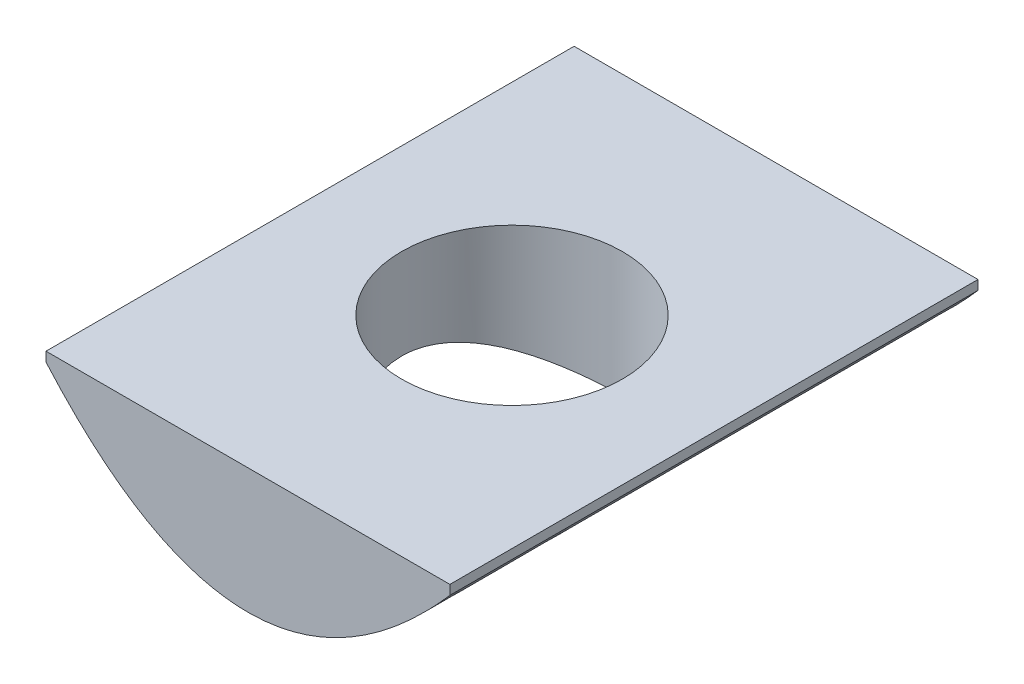
ISO-10303-21;
HEADER;
FILE_DESCRIPTION(('STEP AP214'),'2;1');
FILE_NAME('part.step','',(''),(''),'','','');
FILE_SCHEMA(('AUTOMOTIVE_DESIGN { 1 0 10303 214 1 1 1 1 }'));
ENDSEC;
DATA;
#1=APPLICATION_CONTEXT('core data for automotive mechanical design processes');
#2=APPLICATION_PROTOCOL_DEFINITION('international standard','automotive_design',2000,#1);
#3=PRODUCT_CONTEXT('',#1,'mechanical');
#4=PRODUCT('Part','Part','',(#3));
#5=PRODUCT_RELATED_PRODUCT_CATEGORY('part','',(#4));
#6=PRODUCT_DEFINITION_FORMATION('','',#4);
#7=PRODUCT_DEFINITION_CONTEXT('part definition',#1,'design');
#8=PRODUCT_DEFINITION('design','',#6,#7);
#9=PRODUCT_DEFINITION_SHAPE('','',#8);
#10=(LENGTH_UNIT() NAMED_UNIT(*) SI_UNIT(.MILLI.,.METRE.));
#11=(NAMED_UNIT(*) PLANE_ANGLE_UNIT() SI_UNIT($,.RADIAN.));
#12=(NAMED_UNIT(*) SI_UNIT($,.STERADIAN.) SOLID_ANGLE_UNIT());
#13=UNCERTAINTY_MEASURE_WITH_UNIT(LENGTH_MEASURE(1.E-05),#10,'distance_accuracy_value','');
#14=(GEOMETRIC_REPRESENTATION_CONTEXT(3) GLOBAL_UNCERTAINTY_ASSIGNED_CONTEXT((#13)) GLOBAL_UNIT_ASSIGNED_CONTEXT((#10,
#11,#12)) REPRESENTATION_CONTEXT('',''));
#15=CARTESIAN_POINT('',(0.,0.,0.));
#16=DIRECTION('',(0.,0.,1.));
#17=DIRECTION('',(1.,0.,0.));
#18=AXIS2_PLACEMENT_3D('',#15,#16,#17);
#19=CARTESIAN_POINT('',(-5.4102,0.,14.1478));
#20=DIRECTION('',(1.,0.,0.));
#21=DIRECTION('',(0.,1.,0.));
#22=AXIS2_PLACEMENT_3D('',#19,#20,#21);
#23=PLANE('',#22);
#24=DIRECTION('',(0.,-1.,0.));
#25=VECTOR('',#24,1.);
#26=CARTESIAN_POINT('',(-5.4102,0.,0.));
#27=LINE('',#26,#25);
#28=CARTESIAN_POINT('',(-5.4102,0.,0.));
#29=VERTEX_POINT('',#28);
#30=CARTESIAN_POINT('',(-5.4102,-0.254,0.));
#31=VERTEX_POINT('',#30);
#32=EDGE_CURVE('E104',#29,#31,#27,.T.);
#33=ORIENTED_EDGE('',*,*,#32,.T.);
#34=DIRECTION('',(0.,0.,-1.));
#35=VECTOR('',#34,1.);
#36=CARTESIAN_POINT('',(-5.4102,-0.254,14.1478));
#37=LINE('',#36,#35);
#38=CARTESIAN_POINT('',(-5.4102,-0.254,14.1478));
#39=VERTEX_POINT('',#38);
#40=EDGE_CURVE('E11',#39,#31,#37,.T.);
#41=ORIENTED_EDGE('',*,*,#40,.F.);
#42=DIRECTION('',(0.,-1.,0.));
#43=VECTOR('',#42,1.);
#44=CARTESIAN_POINT('',(-5.4102,0.,14.1478));
#45=LINE('',#44,#43);
#46=CARTESIAN_POINT('',(-5.4102,0.,14.1478));
#47=VERTEX_POINT('',#46);
#48=EDGE_CURVE('E87',#47,#39,#45,.T.);
#49=ORIENTED_EDGE('',*,*,#48,.F.);
#50=DIRECTION('',(0.,0.,-1.));
#51=VECTOR('',#50,1.);
#52=CARTESIAN_POINT('',(-5.4102,0.,14.1478));
#53=LINE('',#52,#51);
#54=EDGE_CURVE('E54',#47,#29,#53,.T.);
#55=ORIENTED_EDGE('',*,*,#54,.T.);
#56=EDGE_LOOP('',(#33,#41,#49,#55));
#57=FACE_BOUND('',#56,.T.);
#58=ADVANCED_FACE('F38',(#57),#23,.F.);
#59=CARTESIAN_POINT('',(-5.4102,-0.254,14.1478));
#60=CARTESIAN_POINT('',(6.34474339659379E-06,-6.4516005032583,14.1478));
#61=CARTESIAN_POINT('',(5.4102,-0.254,14.1478));
#62=B_SPLINE_CURVE_WITH_KNOTS('',2,(#59,#60,#61),.UNSPECIFIED.,.F.,.F.,(3,3),(0.,1.),.UNSPECIFIED.);
#63=DIRECTION('',(0.,0.,-1.));
#64=VECTOR('',#63,1.);
#65=SURFACE_OF_LINEAR_EXTRUSION('',#62,#64);
#66=CARTESIAN_POINT('',(-2.95909999999992,-2.4257850007738,7.0739));
#67=CARTESIAN_POINT('',(-2.95910155575033,-2.42578324394392,7.14975788518106));
#68=CARTESIAN_POINT('',(-2.95618027010238,-2.42761687921527,7.22559992110778));
#69=CARTESIAN_POINT('',(-2.94454274567432,-2.43488718088915,7.37668784572179));
#70=CARTESIAN_POINT('',(-2.93582508357045,-2.44032473224685,7.45193358339221));
#71=CARTESIAN_POINT('',(-2.91270623783965,-2.45463934176923,7.60127937510899));
#72=CARTESIAN_POINT('',(-2.89830018251729,-2.46351934802723,7.67537839039418));
#73=CARTESIAN_POINT('',(-2.86400243650349,-2.484441846718,7.82185103516712));
#74=CARTESIAN_POINT('',(-2.8441084085587,-2.49648568648014,7.89422391521724));
#75=CARTESIAN_POINT('',(-2.77679134628277,-2.5367069361701,8.10721808862584));
#76=CARTESIAN_POINT('',(-2.72158064409368,-2.56907328661306,8.24467608098714));
#77=CARTESIAN_POINT('',(-2.59248468194782,-2.64169822712562,8.50808091981414));
#78=CARTESIAN_POINT('',(-2.51859575734378,-2.6819583655998,8.6340255007505));
#79=CARTESIAN_POINT('',(-2.34670829684544,-2.77062538723167,8.88335447828144));
#80=CARTESIAN_POINT('',(-2.24715357289462,-2.81943804082794,9.00552315316439));
#81=CARTESIAN_POINT('',(-2.03011364377684,-2.91772674406611,9.23251846413394));
#82=CARTESIAN_POINT('',(-1.9126133051265,-2.96720332116733,9.33733030629446));
#83=CARTESIAN_POINT('',(-1.64806120304159,-3.06728132675758,9.53772539320782));
#84=CARTESIAN_POINT('',(-1.49920191803278,-3.1174552652414,9.63118367961926));
#85=CARTESIAN_POINT('',(-1.263501875402,-3.18444410046213,9.7511437528189));
#86=CARTESIAN_POINT('',(-1.18284028104731,-3.20540014217975,9.78776726830039));
#87=CARTESIAN_POINT('',(-1.01785687480364,-3.24383466662989,9.85384955496454));
#88=CARTESIAN_POINT('',(-0.93353749793776,-3.26131542089816,9.88331300896395));
#89=CARTESIAN_POINT('',(-0.768598028789895,-3.29092168484371,9.93263257669461));
#90=CARTESIAN_POINT('',(-0.688204294542441,-3.30335907808869,9.95305981301206));
#91=CARTESIAN_POINT('',(-0.525524721249312,-3.32426112600528,9.98714496583112));
#92=CARTESIAN_POINT('',(-0.443239986238496,-3.33272803992999,10.0008067322195));
#93=CARTESIAN_POINT('',(-0.277542789297945,-3.34537115499417,10.0211369018438));
#94=CARTESIAN_POINT('',(-0.19413118659894,-3.34955045688393,10.0278103590148));
#95=CARTESIAN_POINT('',(-0.0269395581516571,-3.35346287969927,10.0340592183736));
#96=CARTESIAN_POINT('',(0.0568404355185832,-3.35319638037228,10.0336352268049));
#97=CARTESIAN_POINT('',(0.212410221501387,-3.34857369959254,10.0262479083843));
#98=CARTESIAN_POINT('',(0.284262384289898,-3.34478575941295,10.0201931495805));
#99=CARTESIAN_POINT('',(0.427120912444159,-3.33402697389136,10.0028962088644));
#100=CARTESIAN_POINT('',(0.498127008615237,-3.32705514188243,9.99165241889455));
#101=CARTESIAN_POINT('',(0.638775348125541,-3.3101260834878,9.96412005622922));
#102=CARTESIAN_POINT('',(0.708417867890002,-3.30016946899669,9.94783251750367));
#103=CARTESIAN_POINT('',(0.845943808091944,-3.27754072638448,9.91040100589514));
#104=CARTESIAN_POINT('',(0.913826554437023,-3.26486757441456,9.8892552017408));
#105=CARTESIAN_POINT('',(1.11592019772906,-3.22289717950781,9.81826173923299));
#106=CARTESIAN_POINT('',(1.24689325628923,-3.189862761647,9.76119187464609));
#107=CARTESIAN_POINT('',(1.49785205219057,-3.1169524190658,9.62983847514835));
#108=CARTESIAN_POINT('',(1.61782878535346,-3.07707096317613,9.55554100630146));
#109=CARTESIAN_POINT('',(1.79629068429304,-3.01164453412536,9.4267708480175));
#110=CARTESIAN_POINT('',(1.85904588541713,-2.98730303504798,9.37749803509169));
#111=CARTESIAN_POINT('',(1.98019037129675,-2.93806257523052,9.2742287198395));
#112=CARTESIAN_POINT('',(2.03858373950539,-2.91316416497673,9.22023674094433));
#113=CARTESIAN_POINT('',(2.20710360097129,-2.83842027001326,9.05134552200964));
#114=CARTESIAN_POINT('',(2.31048038849287,-2.78856029968815,8.92959576234755));
#115=CARTESIAN_POINT('',(2.50563241489125,-2.6892395104989,8.6577323525599));
#116=CARTESIAN_POINT('',(2.59547534942246,-2.64023429799889,8.50604168033736));
#117=CARTESIAN_POINT('',(2.70957744268317,-2.57568666091692,8.2665039295091));
#118=CARTESIAN_POINT('',(2.74416950184487,-2.55566302671934,8.18465139805429));
#119=CARTESIAN_POINT('',(2.80606200602994,-2.51929627239442,8.01741768184001));
#120=CARTESIAN_POINT('',(2.83336354268317,-2.50295260131368,7.93203702756925));
#121=CARTESIAN_POINT('',(2.87809500527859,-2.47589479572932,7.76637530450449));
#122=CARTESIAN_POINT('',(2.89619686228035,-2.46480387861001,7.68633656919057));
#123=CARTESIAN_POINT('',(2.92573083696506,-2.44660060166844,7.52459517516842));
#124=CARTESIAN_POINT('',(2.93716399620301,-2.43948762055674,7.44289277836432));
#125=CARTESIAN_POINT('',(2.95316198334127,-2.42951132479795,7.27862413669357));
#126=CARTESIAN_POINT('',(2.95773222622228,-2.42664465974531,7.19605862469708));
#127=CARTESIAN_POINT('',(2.95993968726882,-2.42526177241451,7.03080062138602));
#128=CARTESIAN_POINT('',(2.95757736862607,-2.42674525948556,6.94810813892383));
#129=CARTESIAN_POINT('',(2.94672967510916,-2.43352479463917,6.7942686730351));
#130=CARTESIAN_POINT('',(2.93909268985607,-2.43829236878625,6.72303697222021));
#131=CARTESIAN_POINT('',(2.91873331300211,-2.45091765547078,6.58157516911201));
#132=CARTESIAN_POINT('',(2.90600937451497,-2.45877630795925,6.51134537822253));
#133=CARTESIAN_POINT('',(2.86042026174929,-2.48668559678633,6.30289294745469));
#134=CARTESIAN_POINT('',(2.82012931089566,-2.51107519898566,6.16679119140327));
#135=CARTESIAN_POINT('',(2.72016493314845,-2.5697179905148,5.90008413237997));
#136=CARTESIAN_POINT('',(2.660010021349,-2.60421352065172,5.7697172292704));
#137=CARTESIAN_POINT('',(2.52248224415229,-2.679669012807,5.52031000949572));
#138=CARTESIAN_POINT('',(2.4450954637423,-2.720634191354,5.40127895824892));
#139=CARTESIAN_POINT('',(2.31135196122582,-2.78746534024632,5.22445717842757));
#140=CARTESIAN_POINT('',(2.26017516118626,-2.81228750113928,5.16226446235286));
#141=CARTESIAN_POINT('',(2.15307379331542,-2.86232702174967,5.04239910603751));
#142=CARTESIAN_POINT('',(2.09715375206376,-2.88754398636332,4.98472225510238));
#143=CARTESIAN_POINT('',(1.9224405077531,-2.96297300616273,4.81860574113389));
#144=CARTESIAN_POINT('',(1.79675673855989,-3.01293069585533,4.71716260454288));
#145=CARTESIAN_POINT('',(1.51814679159323,-3.11100440766856,4.52791722675739));
#146=CARTESIAN_POINT('',(1.36384269816276,-3.15864933252004,4.44186773938741));
#147=CARTESIAN_POINT('',(1.12084433201734,-3.22049754964035,4.33385280218582));
#148=CARTESIAN_POINT('',(1.03792092629678,-3.2395104663822,4.30135764450377));
#149=CARTESIAN_POINT('',(0.868737707085259,-3.27365682266016,4.24378726169269));
#150=CARTESIAN_POINT('',(0.782478450151194,-3.28879090615856,4.21871080480726));
#151=CARTESIAN_POINT('',(0.616368240631742,-3.31323439729999,4.17857589717613));
#152=CARTESIAN_POINT('',(0.536764984173961,-3.32298141709498,4.1627548032206));
#153=CARTESIAN_POINT('',(0.376150927809358,-3.33850345409563,4.13768033911359));
#154=CARTESIAN_POINT('',(0.295140336532061,-3.34427905497641,4.12842600384634));
#155=CARTESIAN_POINT('',(0.132493465692102,-3.35164160943207,4.11664407065157));
#156=CARTESIAN_POINT('',(0.0508576210206347,-3.35323124864738,4.11411215972451));
#157=CARTESIAN_POINT('',(-0.112311633106154,-3.35216930199908,4.11580691510348));
#158=CARTESIAN_POINT('',(-0.193845050474874,-3.34951806689002,4.12003302246681));
#159=CARTESIAN_POINT('',(-0.345922324181204,-3.3406651277341,4.13422428518582));
#160=CARTESIAN_POINT('',(-0.416568747771942,-3.33494738465681,4.14340808015141));
#161=CARTESIAN_POINT('',(-0.556725133699432,-3.3205077824817,4.16677337590785));
#162=CARTESIAN_POINT('',(-0.626234747460923,-3.31178501940904,4.18095638059862));
#163=CARTESIAN_POINT('',(-0.832356694999482,-3.28144345961716,4.23076903590894));
#164=CARTESIAN_POINT('',(-0.966674233055766,-3.25564431145965,4.27367309488247));
#165=CARTESIAN_POINT('',(-1.23123928289376,-3.19424029858113,4.37919273053516));
#166=CARTESIAN_POINT('',(-1.36111617301195,-3.1582882095314,4.44252028976383));
#167=CARTESIAN_POINT('',(-1.60900937382756,-3.08034305091808,4.58634959919613));
#168=CARTESIAN_POINT('',(-1.72701999322131,-3.03834710585354,4.66685953315827));
#169=CARTESIAN_POINT('',(-1.96580022055222,-2.94540460440143,4.85615964174748));
#170=CARTESIAN_POINT('',(-2.08450075850983,-2.89404194218914,4.96735582637628));
#171=CARTESIAN_POINT('',(-2.30259005029578,-2.79275314775803,5.20822496546023));
#172=CARTESIAN_POINT('',(-2.40195819248352,-2.74282859658647,5.33791738760311));
#173=CARTESIAN_POINT('',(-2.53764493615823,-2.67127979777539,5.54933244952875));
#174=CARTESIAN_POINT('',(-2.58179934635442,-2.64728859199363,5.62532732319166));
#175=CARTESIAN_POINT('',(-2.66343401236004,-2.60195648027544,5.78155708881021));
#176=CARTESIAN_POINT('',(-2.70091755486041,-2.58061427077371,5.86178986736891));
#177=CARTESIAN_POINT('',(-2.76870394754778,-2.54136161109454,6.02584821499166));
#178=CARTESIAN_POINT('',(-2.79902125573365,-2.52344426542333,6.10966614017628));
#179=CARTESIAN_POINT('',(-2.85211433984992,-2.49167983805471,6.28036319121354));
#180=CARTESIAN_POINT('',(-2.87489417604963,-2.47783056542925,6.36724064096901));
#181=CARTESIAN_POINT('',(-2.91531102295733,-2.45306802674015,6.55630871241523));
#182=CARTESIAN_POINT('',(-2.93169448866571,-2.44288875961207,6.65886844324594));
#183=CARTESIAN_POINT('',(-2.95358744166761,-2.42924874145488,6.86559549840668));
#184=CARTESIAN_POINT('',(-2.95909786427373,-2.42578741254085,6.96976268368453));
#185=CARTESIAN_POINT('',(-2.95909999999992,-2.4257850007738,7.0739));
#186=B_SPLINE_CURVE_WITH_KNOTS('',3,(#66,#67,#68,#69,#70,#71,#72,#73,#74,#75,#76,#77,#78,#79,
#80,#81,#82,#83,#84,#85,#86,#87,#88,#89,#90,#91,#92,#93,#94,#95,#96,#97,#98,#99,#100,#101,#102,
#103,#104,#105,#106,#107,#108,#109,#110,#111,#112,#113,#114,#115,#116,#117,#118,#119,#120,#121,
#122,#123,#124,#125,#126,#127,#128,#129,#130,#131,#132,#133,#134,#135,#136,#137,#138,#139,#140,
#141,#142,#143,#144,#145,#146,#147,#148,#149,#150,#151,#152,#153,#154,#155,#156,#157,#158,#159,
#160,#161,#162,#163,#164,#165,#166,#167,#168,#169,#170,#171,#172,#173,#174,#175,#176,#177,#178,
#179,#180,#181,#182,#183,#184,#185),.UNSPECIFIED.,.T.,.F.,(4,2,2,2,2,2,2,2,2,2,2,2,2,2,2,2,2,2,
2,2,2,2,2,2,2,2,2,2,2,2,2,2,2,2,2,2,2,2,2,2,2,2,2,2,2,2,2,2,2,2,2,2,2,2,2,2,2,2,2,4),(0.,
0.227468236194017,0.454992348774853,0.682711743335688,0.910528270634619,1.36326401987308,
1.81608866441714,2.30903774886775,2.80240485485,3.34758190380341,3.62033621525785,
3.89291165718489,4.1441714449478,4.39528808870271,4.64622299958151,4.89713647643853,
5.11349682458719,5.32992426691639,5.54630737089821,5.76277217239074,6.20083034827399,
6.63924407552829,6.88926998731501,7.13905881785895,7.63897956881311,8.18472928264412,
8.45764343287422,8.73051669598066,8.97857526655854,9.22659508356172,9.47441910486701,
9.7222265684513,9.93736072406515,10.1525603494185,10.5826144136033,11.0239688018897,
11.4656808918659,11.7182936437919,11.9706679771853,12.4757385789765,13.021421598106,
13.2942646212031,13.5670623176309,13.8119397690589,14.0567812234173,14.3014655534272,
14.5461296471128,14.7602846773723,14.9745041864215,15.4026087907391,15.8476318852914,
16.2928674139181,16.8024913345695,17.3126556591789,17.5856569960645,17.858523452423,
18.130834605439,18.4029988307461,18.7152929256445,19.0275601554482),.UNSPECIFIED.);
#187=CARTESIAN_POINT('',(-2.95909999999992,-2.4257850007738,7.0739));
#188=VERTEX_POINT('',#187);
#189=EDGE_CURVE('E106',#188,#188,#186,.T.);
#190=ORIENTED_EDGE('',*,*,#189,.T.);
#191=EDGE_LOOP('',(#190));
#192=FACE_BOUND('',#191,.T.);
#193=CARTESIAN_POINT('',(-5.4102,-0.254,0.));
#194=CARTESIAN_POINT('',(6.34474339659379E-06,-6.4516005032583,0.));
#195=CARTESIAN_POINT('',(5.4102,-0.254,0.));
#196=B_SPLINE_CURVE_WITH_KNOTS('',2,(#193,#194,#195),.UNSPECIFIED.,.F.,.F.,(3,3),(0.,1.),.UNSPECIFIED.);
#197=CARTESIAN_POINT('',(5.4102,-0.254,0.));
#198=VERTEX_POINT('',#197);
#199=EDGE_CURVE('E92',#31,#198,#196,.T.);
#200=ORIENTED_EDGE('',*,*,#199,.T.);
#201=DIRECTION('',(0.,0.,-1.));
#202=VECTOR('',#201,1.);
#203=CARTESIAN_POINT('',(5.4102,-0.254,14.1478));
#204=LINE('',#203,#202);
#205=CARTESIAN_POINT('',(5.4102,-0.254,14.1478));
#206=VERTEX_POINT('',#205);
#207=EDGE_CURVE('E46',#206,#198,#204,.T.);
#208=ORIENTED_EDGE('',*,*,#207,.F.);
#209=EDGE_CURVE('E79',#39,#206,#62,.T.);
#210=ORIENTED_EDGE('',*,*,#209,.F.);
#211=ORIENTED_EDGE('',*,*,#40,.T.);
#212=EDGE_LOOP('',(#200,#208,#210,#211));
#213=FACE_BOUND('',#212,.T.);
#214=ADVANCED_FACE('F91',(#192,#213),#65,.F.);
#215=CARTESIAN_POINT('',(5.4102,0.,14.1478));
#216=DIRECTION('',(1.,0.,0.));
#217=DIRECTION('',(0.,0.,-1.));
#218=AXIS2_PLACEMENT_3D('',#215,#216,#217);
#219=PLANE('',#218);
#220=DIRECTION('',(0.,-1.,0.));
#221=VECTOR('',#220,1.);
#222=CARTESIAN_POINT('',(5.4102,0.,0.));
#223=LINE('',#222,#221);
#224=CARTESIAN_POINT('',(5.4102,0.,0.));
#225=VERTEX_POINT('',#224);
#226=EDGE_CURVE('E110',#225,#198,#223,.T.);
#227=ORIENTED_EDGE('',*,*,#226,.F.);
#228=DIRECTION('',(0.,0.,-1.));
#229=VECTOR('',#228,1.);
#230=CARTESIAN_POINT('',(5.4102,0.,14.1478));
#231=LINE('',#230,#229);
#232=CARTESIAN_POINT('',(5.4102,0.,14.1478));
#233=VERTEX_POINT('',#232);
#234=EDGE_CURVE('E68',#233,#225,#231,.T.);
#235=ORIENTED_EDGE('',*,*,#234,.F.);
#236=DIRECTION('',(0.,-1.,0.));
#237=VECTOR('',#236,1.);
#238=CARTESIAN_POINT('',(5.4102,0.,14.1478));
#239=LINE('',#238,#237);
#240=EDGE_CURVE('E86',#233,#206,#239,.T.);
#241=ORIENTED_EDGE('',*,*,#240,.T.);
#242=ORIENTED_EDGE('',*,*,#207,.T.);
#243=EDGE_LOOP('',(#227,#235,#241,#242));
#244=FACE_BOUND('',#243,.T.);
#245=ADVANCED_FACE('F95',(#244),#219,.T.);
#246=CARTESIAN_POINT('',(0.,0.,14.1478));
#247=DIRECTION('',(0.,1.,0.));
#248=DIRECTION('',(-1.,0.,0.));
#249=AXIS2_PLACEMENT_3D('',#246,#247,#248);
#250=PLANE('',#249);
#251=CARTESIAN_POINT('',(0.,0.,7.0739));
#252=DIRECTION('',(0.,1.,0.));
#253=DIRECTION('',(-1.,0.,0.));
#254=AXIS2_PLACEMENT_3D('',#251,#252,#253);
#255=CIRCLE('',#254,2.9591);
#256=CARTESIAN_POINT('',(-2.9591,0.,7.0739));
#257=VERTEX_POINT('',#256);
#258=EDGE_CURVE('E127',#257,#257,#255,.T.);
#259=ORIENTED_EDGE('',*,*,#258,.F.);
#260=EDGE_LOOP('',(#259));
#261=FACE_BOUND('',#260,.T.);
#262=DIRECTION('',(1.,0.,0.));
#263=VECTOR('',#262,1.);
#264=CARTESIAN_POINT('',(0.,0.,0.));
#265=LINE('',#264,#263);
#266=EDGE_CURVE('E115',#29,#225,#265,.T.);
#267=ORIENTED_EDGE('',*,*,#266,.F.);
#268=ORIENTED_EDGE('',*,*,#54,.F.);
#269=DIRECTION('',(1.,0.,0.));
#270=VECTOR('',#269,1.);
#271=CARTESIAN_POINT('',(0.,0.,14.1478));
#272=LINE('',#271,#270);
#273=EDGE_CURVE('E96',#47,#233,#272,.T.);
#274=ORIENTED_EDGE('',*,*,#273,.T.);
#275=ORIENTED_EDGE('',*,*,#234,.T.);
#276=EDGE_LOOP('',(#267,#268,#274,#275));
#277=FACE_BOUND('',#276,.T.);
#278=ADVANCED_FACE('F138',(#261,#277),#250,.T.);
#279=CARTESIAN_POINT('',(0.,0.,14.1478));
#280=DIRECTION('',(0.,0.,1.));
#281=DIRECTION('',(1.,0.,0.));
#282=AXIS2_PLACEMENT_3D('',#279,#280,#281);
#283=PLANE('',#282);
#284=ORIENTED_EDGE('',*,*,#48,.T.);
#285=ORIENTED_EDGE('',*,*,#209,.T.);
#286=ORIENTED_EDGE('',*,*,#240,.F.);
#287=ORIENTED_EDGE('',*,*,#273,.F.);
#288=EDGE_LOOP('',(#284,#285,#286,#287));
#289=FACE_BOUND('',#288,.T.);
#290=ADVANCED_FACE('F83',(#289),#283,.T.);
#291=CARTESIAN_POINT('',(0.,0.,0.));
#292=DIRECTION('',(0.,0.,1.));
#293=DIRECTION('',(1.,0.,0.));
#294=AXIS2_PLACEMENT_3D('',#291,#292,#293);
#295=PLANE('',#294);
#296=ORIENTED_EDGE('',*,*,#32,.F.);
#297=ORIENTED_EDGE('',*,*,#266,.T.);
#298=ORIENTED_EDGE('',*,*,#226,.T.);
#299=ORIENTED_EDGE('',*,*,#199,.F.);
#300=EDGE_LOOP('',(#296,#297,#298,#299));
#301=FACE_BOUND('',#300,.T.);
#302=ADVANCED_FACE('F134',(#301),#295,.F.);
#303=CARTESIAN_POINT('',(0.,-14.1478,7.0739));
#304=DIRECTION('',(0.,1.,0.));
#305=DIRECTION('',(-1.,0.,0.));
#306=AXIS2_PLACEMENT_3D('',#303,#304,#305);
#307=CYLINDRICAL_SURFACE('',#306,2.9591);
#308=ORIENTED_EDGE('',*,*,#258,.T.);
#309=EDGE_LOOP('',(#308));
#310=FACE_BOUND('',#309,.T.);
#311=ORIENTED_EDGE('',*,*,#189,.F.);
#312=EDGE_LOOP('',(#311));
#313=FACE_BOUND('',#312,.T.);
#314=ADVANCED_FACE('F130',(#310,#313),#307,.F.);
#315=CLOSED_SHELL('',(#58,#214,#245,#278,#290,#302,#314));
#316=MANIFOLD_SOLID_BREP('B2',#315);
#317=ADVANCED_BREP_SHAPE_REPRESENTATION('',(#18,#316),#14);
#318=SHAPE_DEFINITION_REPRESENTATION(#9,#317);
ENDSEC;
END-ISO-10303-21;
